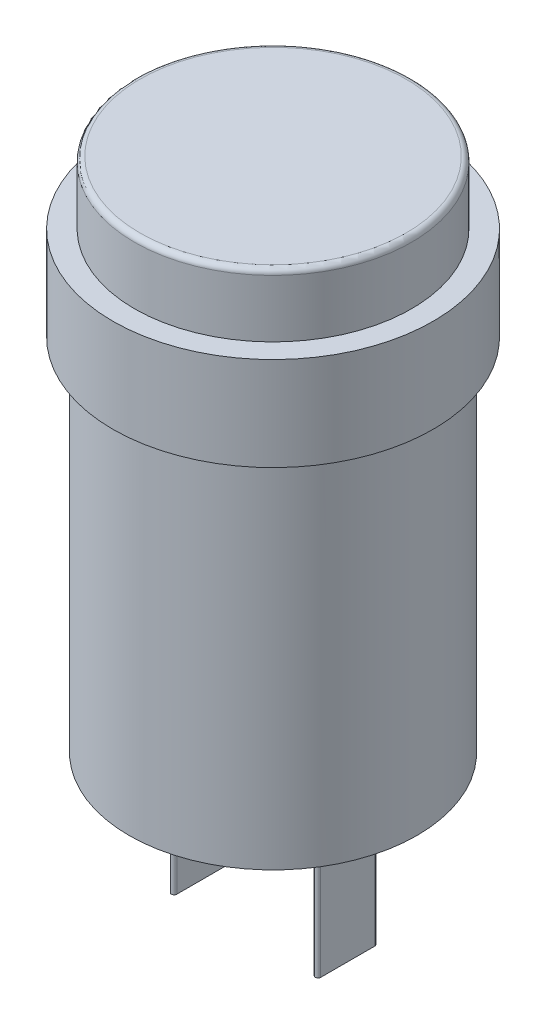
ISO-10303-21;
HEADER;
FILE_DESCRIPTION(('STEP AP214'),'2;1');
FILE_NAME('part.step','',(''),(''),'','','');
FILE_SCHEMA(('AUTOMOTIVE_DESIGN { 1 0 10303 214 1 1 1 1 }'));
ENDSEC;
DATA;
#1=APPLICATION_CONTEXT('core data for automotive mechanical design processes');
#2=APPLICATION_PROTOCOL_DEFINITION('international standard','automotive_design',2000,#1);
#3=PRODUCT_CONTEXT('',#1,'mechanical');
#4=PRODUCT('Part','Part','',(#3));
#5=PRODUCT_RELATED_PRODUCT_CATEGORY('part','',(#4));
#6=PRODUCT_DEFINITION_FORMATION('','',#4);
#7=PRODUCT_DEFINITION_CONTEXT('part definition',#1,'design');
#8=PRODUCT_DEFINITION('design','',#6,#7);
#9=PRODUCT_DEFINITION_SHAPE('','',#8);
#10=(LENGTH_UNIT() NAMED_UNIT(*) SI_UNIT(.MILLI.,.METRE.));
#11=(NAMED_UNIT(*) PLANE_ANGLE_UNIT() SI_UNIT($,.RADIAN.));
#12=(NAMED_UNIT(*) SI_UNIT($,.STERADIAN.) SOLID_ANGLE_UNIT());
#13=UNCERTAINTY_MEASURE_WITH_UNIT(LENGTH_MEASURE(1.E-05),#10,'distance_accuracy_value','');
#14=(GEOMETRIC_REPRESENTATION_CONTEXT(3) GLOBAL_UNCERTAINTY_ASSIGNED_CONTEXT((#13)) GLOBAL_UNIT_ASSIGNED_CONTEXT((#10,
#11,#12)) REPRESENTATION_CONTEXT('',''));
#15=CARTESIAN_POINT('',(0.,0.,0.));
#16=DIRECTION('',(0.,0.,1.));
#17=DIRECTION('',(1.,0.,0.));
#18=AXIS2_PLACEMENT_3D('',#15,#16,#17);
#19=CARTESIAN_POINT('',(0.,9.19984369533566,0.));
#20=DIRECTION('',(0.,1.,0.));
#21=DIRECTION('',(0.,0.,1.));
#22=AXIS2_PLACEMENT_3D('',#19,#20,#21);
#23=PLANE('',#22);
#24=CARTESIAN_POINT('',(0.,9.19984369533566,0.));
#25=DIRECTION('',(0.,1.,0.));
#26=DIRECTION('',(0.,0.,1.));
#27=AXIS2_PLACEMENT_3D('',#24,#25,#26);
#28=CIRCLE('',#27,12.2375);
#29=CARTESIAN_POINT('',(0.,9.19984369533566,12.2375));
#30=VERTEX_POINT('',#29);
#31=EDGE_CURVE('E164',#30,#30,#28,.T.);
#32=ORIENTED_EDGE('',*,*,#31,.T.);
#33=EDGE_LOOP('',(#32));
#34=FACE_BOUND('',#33,.T.);
#35=CARTESIAN_POINT('',(0.,9.19984369533566,0.));
#36=DIRECTION('',(0.,1.,0.));
#37=DIRECTION('',(0.,0.,1.));
#38=AXIS2_PLACEMENT_3D('',#35,#36,#37);
#39=CIRCLE('',#38,10.5875);
#40=CARTESIAN_POINT('',(0.,9.19984369533566,10.5875));
#41=VERTEX_POINT('',#40);
#42=EDGE_CURVE('E229',#41,#41,#39,.T.);
#43=ORIENTED_EDGE('',*,*,#42,.F.);
#44=EDGE_LOOP('',(#43));
#45=FACE_BOUND('',#44,.T.);
#46=ADVANCED_FACE('F38',(#34,#45),#23,.T.);
#47=CARTESIAN_POINT('',(0.,-25.4501563046643,0.));
#48=DIRECTION('',(0.,-1.,0.));
#49=DIRECTION('',(0.,0.,-1.));
#50=AXIS2_PLACEMENT_3D('',#47,#48,#49);
#51=PLANE('',#50);
#52=DIRECTION('',(0.,0.,-1.));
#53=VECTOR('',#52,1.);
#54=CARTESIAN_POINT('',(5.29375,-25.4501563046643,2.0625));
#55=LINE('',#54,#53);
#56=CARTESIAN_POINT('',(5.29375,-25.4501563046643,2.0625));
#57=VERTEX_POINT('',#56);
#58=CARTESIAN_POINT('',(5.29375,-25.4501563046643,-2.0625));
#59=VERTEX_POINT('',#58);
#60=EDGE_CURVE('E132',#57,#59,#55,.T.);
#61=ORIENTED_EDGE('',*,*,#60,.F.);
#62=CARTESIAN_POINT('',(5.5,-25.4501563046643,2.0625));
#63=DIRECTION('',(0.,-1.,0.));
#64=DIRECTION('',(0.,0.,-1.));
#65=AXIS2_PLACEMENT_3D('',#62,#63,#64);
#66=CIRCLE('',#65,0.206249999999999);
#67=CARTESIAN_POINT('',(5.70625,-25.4501563046643,2.0625));
#68=VERTEX_POINT('',#67);
#69=EDGE_CURVE('E129',#68,#57,#66,.T.);
#70=ORIENTED_EDGE('',*,*,#69,.F.);
#71=DIRECTION('',(0.,0.,1.));
#72=VECTOR('',#71,1.);
#73=CARTESIAN_POINT('',(5.70625,-25.4501563046643,2.0625));
#74=LINE('',#73,#72);
#75=CARTESIAN_POINT('',(5.70625,-25.4501563046643,-2.0625));
#76=VERTEX_POINT('',#75);
#77=EDGE_CURVE('E141',#76,#68,#74,.T.);
#78=ORIENTED_EDGE('',*,*,#77,.F.);
#79=CARTESIAN_POINT('',(5.5,-25.4501563046643,-2.0625));
#80=DIRECTION('',(0.,-1.,0.));
#81=DIRECTION('',(0.,0.,-1.));
#82=AXIS2_PLACEMENT_3D('',#79,#80,#81);
#83=CIRCLE('',#82,0.206249999999999);
#84=EDGE_CURVE('E149',#59,#76,#83,.T.);
#85=ORIENTED_EDGE('',*,*,#84,.F.);
#86=EDGE_LOOP('',(#61,#70,#78,#85));
#87=FACE_BOUND('',#86,.T.);
#88=CARTESIAN_POINT('',(0.,-25.4501563046643,0.));
#89=DIRECTION('',(0.,-1.,0.));
#90=DIRECTION('',(0.,0.,-1.));
#91=AXIS2_PLACEMENT_3D('',#88,#89,#90);
#92=CIRCLE('',#91,11.);
#93=CARTESIAN_POINT('',(0.,-25.4501563046643,-11.));
#94=VERTEX_POINT('',#93);
#95=EDGE_CURVE('E160',#94,#94,#92,.T.);
#96=ORIENTED_EDGE('',*,*,#95,.T.);
#97=EDGE_LOOP('',(#96));
#98=FACE_BOUND('',#97,.T.);
#99=DIRECTION('',(0.,0.,-1.));
#100=VECTOR('',#99,1.);
#101=CARTESIAN_POINT('',(-5.70625,-25.4501563046643,2.0625));
#102=LINE('',#101,#100);
#103=CARTESIAN_POINT('',(-5.70625,-25.4501563046643,2.0625));
#104=VERTEX_POINT('',#103);
#105=CARTESIAN_POINT('',(-5.70625,-25.4501563046643,-2.0625));
#106=VERTEX_POINT('',#105);
#107=EDGE_CURVE('E224',#104,#106,#102,.T.);
#108=ORIENTED_EDGE('',*,*,#107,.F.);
#109=CARTESIAN_POINT('',(-5.5,-25.4501563046643,2.0625));
#110=DIRECTION('',(0.,-1.,0.));
#111=DIRECTION('',(0.,0.,-1.));
#112=AXIS2_PLACEMENT_3D('',#109,#110,#111);
#113=CIRCLE('',#112,0.206249999999999);
#114=CARTESIAN_POINT('',(-5.29375,-25.4501563046643,2.0625));
#115=VERTEX_POINT('',#114);
#116=EDGE_CURVE('E127',#115,#104,#113,.T.);
#117=ORIENTED_EDGE('',*,*,#116,.F.);
#118=DIRECTION('',(0.,0.,1.));
#119=VECTOR('',#118,1.);
#120=CARTESIAN_POINT('',(-5.29375,-25.4501563046643,2.0625));
#121=LINE('',#120,#119);
#122=CARTESIAN_POINT('',(-5.29375,-25.4501563046643,-2.0625));
#123=VERTEX_POINT('',#122);
#124=EDGE_CURVE('E123',#123,#115,#121,.T.);
#125=ORIENTED_EDGE('',*,*,#124,.F.);
#126=CARTESIAN_POINT('',(-5.5,-25.4501563046643,-2.0625));
#127=DIRECTION('',(0.,-1.,0.));
#128=DIRECTION('',(0.,0.,-1.));
#129=AXIS2_PLACEMENT_3D('',#126,#127,#128);
#130=CIRCLE('',#129,0.206249999999999);
#131=EDGE_CURVE('E226',#106,#123,#130,.T.);
#132=ORIENTED_EDGE('',*,*,#131,.F.);
#133=EDGE_LOOP('',(#108,#117,#125,#132));
#134=FACE_BOUND('',#133,.T.);
#135=ADVANCED_FACE('F185',(#87,#98,#134),#51,.T.);
#136=CARTESIAN_POINT('',(0.,2.04984369533566,0.));
#137=DIRECTION('',(0.,1.,0.));
#138=DIRECTION('',(0.,0.,1.));
#139=AXIS2_PLACEMENT_3D('',#136,#137,#138);
#140=PLANE('',#139);
#141=CARTESIAN_POINT('',(0.,2.04984369533566,0.));
#142=DIRECTION('',(0.,1.,0.));
#143=DIRECTION('',(0.,0.,1.));
#144=AXIS2_PLACEMENT_3D('',#141,#142,#143);
#145=CIRCLE('',#144,12.2375);
#146=CARTESIAN_POINT('',(0.,2.04984369533566,12.2375));
#147=VERTEX_POINT('',#146);
#148=EDGE_CURVE('E163',#147,#147,#145,.T.);
#149=ORIENTED_EDGE('',*,*,#148,.F.);
#150=EDGE_LOOP('',(#149));
#151=FACE_BOUND('',#150,.T.);
#152=CARTESIAN_POINT('',(0.,2.04984369533566,0.));
#153=DIRECTION('',(0.,1.,0.));
#154=DIRECTION('',(0.,0.,1.));
#155=AXIS2_PLACEMENT_3D('',#152,#153,#154);
#156=CIRCLE('',#155,11.);
#157=CARTESIAN_POINT('',(0.,2.04984369533566,11.));
#158=VERTEX_POINT('',#157);
#159=EDGE_CURVE('E167',#158,#158,#156,.F.);
#160=ORIENTED_EDGE('',*,*,#159,.F.);
#161=EDGE_LOOP('',(#160));
#162=FACE_BOUND('',#161,.T.);
#163=ADVANCED_FACE('F191',(#151,#162),#140,.F.);
#164=CARTESIAN_POINT('',(0.,9.19984369533566,0.));
#165=DIRECTION('',(0.,-1.,0.));
#166=DIRECTION('',(0.,0.,-1.));
#167=AXIS2_PLACEMENT_3D('',#164,#165,#166);
#168=CYLINDRICAL_SURFACE('',#167,12.2375);
#169=ORIENTED_EDGE('',*,*,#31,.F.);
#170=EDGE_LOOP('',(#169));
#171=FACE_BOUND('',#170,.T.);
#172=ORIENTED_EDGE('',*,*,#148,.T.);
#173=EDGE_LOOP('',(#172));
#174=FACE_BOUND('',#173,.T.);
#175=ADVANCED_FACE('F199',(#171,#174),#168,.T.);
#176=CARTESIAN_POINT('',(0.,-25.4501563046643,0.));
#177=DIRECTION('',(0.,1.,0.));
#178=DIRECTION('',(0.,0.,1.));
#179=AXIS2_PLACEMENT_3D('',#176,#177,#178);
#180=CYLINDRICAL_SURFACE('',#179,11.);
#181=ORIENTED_EDGE('',*,*,#95,.F.);
#182=EDGE_LOOP('',(#181));
#183=FACE_BOUND('',#182,.T.);
#184=ORIENTED_EDGE('',*,*,#159,.T.);
#185=EDGE_LOOP('',(#184));
#186=FACE_BOUND('',#185,.T.);
#187=ADVANCED_FACE('F197',(#183,#186),#180,.T.);
#188=CARTESIAN_POINT('',(5.5,-36.4501563046643,2.0625));
#189=DIRECTION('',(0.,1.,0.));
#190=DIRECTION('',(0.,0.,1.));
#191=AXIS2_PLACEMENT_3D('',#188,#189,#190);
#192=CYLINDRICAL_SURFACE('',#191,0.206249999999999);
#193=ORIENTED_EDGE('',*,*,#69,.T.);
#194=DIRECTION('',(0.,1.,0.));
#195=VECTOR('',#194,1.);
#196=CARTESIAN_POINT('',(5.29375,-36.4501563046643,2.0625));
#197=LINE('',#196,#195);
#198=CARTESIAN_POINT('',(5.29375,-36.4501563046643,2.0625));
#199=VERTEX_POINT('',#198);
#200=EDGE_CURVE('E158',#199,#57,#197,.T.);
#201=ORIENTED_EDGE('',*,*,#200,.F.);
#202=CARTESIAN_POINT('',(5.5,-36.4501563046643,2.0625));
#203=DIRECTION('',(0.,-1.,0.));
#204=DIRECTION('',(0.,0.,-1.));
#205=AXIS2_PLACEMENT_3D('',#202,#203,#204);
#206=CIRCLE('',#205,0.206249999999999);
#207=CARTESIAN_POINT('',(5.70625,-36.4501563046643,2.0625));
#208=VERTEX_POINT('',#207);
#209=EDGE_CURVE('E137',#208,#199,#206,.T.);
#210=ORIENTED_EDGE('',*,*,#209,.F.);
#211=DIRECTION('',(0.,1.,0.));
#212=VECTOR('',#211,1.);
#213=CARTESIAN_POINT('',(5.70625,-36.4501563046643,2.0625));
#214=LINE('',#213,#212);
#215=EDGE_CURVE('E146',#208,#68,#214,.T.);
#216=ORIENTED_EDGE('',*,*,#215,.T.);
#217=EDGE_LOOP('',(#193,#201,#210,#216));
#218=FACE_BOUND('',#217,.T.);
#219=ADVANCED_FACE('F206',(#218),#192,.T.);
#220=CARTESIAN_POINT('',(5.29375,-36.4501563046643,2.0625));
#221=DIRECTION('',(1.,0.,0.));
#222=DIRECTION('',(0.,0.,-1.));
#223=AXIS2_PLACEMENT_3D('',#220,#221,#222);
#224=PLANE('',#223);
#225=ORIENTED_EDGE('',*,*,#60,.T.);
#226=DIRECTION('',(0.,1.,0.));
#227=VECTOR('',#226,1.);
#228=CARTESIAN_POINT('',(5.29375,-36.4501563046643,-2.0625));
#229=LINE('',#228,#227);
#230=CARTESIAN_POINT('',(5.29375,-36.4501563046643,-2.0625));
#231=VERTEX_POINT('',#230);
#232=EDGE_CURVE('E155',#231,#59,#229,.T.);
#233=ORIENTED_EDGE('',*,*,#232,.F.);
#234=DIRECTION('',(0.,0.,-1.));
#235=VECTOR('',#234,1.);
#236=CARTESIAN_POINT('',(5.29375,-36.4501563046643,2.0625));
#237=LINE('',#236,#235);
#238=EDGE_CURVE('E140',#199,#231,#237,.T.);
#239=ORIENTED_EDGE('',*,*,#238,.F.);
#240=ORIENTED_EDGE('',*,*,#200,.T.);
#241=EDGE_LOOP('',(#225,#233,#239,#240));
#242=FACE_BOUND('',#241,.T.);
#243=ADVANCED_FACE('F217',(#242),#224,.F.);
#244=CARTESIAN_POINT('',(5.5,-36.4501563046643,-2.0625));
#245=DIRECTION('',(0.,1.,0.));
#246=DIRECTION('',(0.,0.,1.));
#247=AXIS2_PLACEMENT_3D('',#244,#245,#246);
#248=CYLINDRICAL_SURFACE('',#247,0.206249999999999);
#249=ORIENTED_EDGE('',*,*,#84,.T.);
#250=DIRECTION('',(0.,1.,0.));
#251=VECTOR('',#250,1.);
#252=CARTESIAN_POINT('',(5.70625,-36.4501563046643,-2.0625));
#253=LINE('',#252,#251);
#254=CARTESIAN_POINT('',(5.70625,-36.4501563046643,-2.0625));
#255=VERTEX_POINT('',#254);
#256=EDGE_CURVE('E61',#255,#76,#253,.T.);
#257=ORIENTED_EDGE('',*,*,#256,.F.);
#258=CARTESIAN_POINT('',(5.5,-36.4501563046643,-2.0625));
#259=DIRECTION('',(0.,-1.,0.));
#260=DIRECTION('',(0.,0.,-1.));
#261=AXIS2_PLACEMENT_3D('',#258,#259,#260);
#262=CIRCLE('',#261,0.206249999999999);
#263=EDGE_CURVE('E143',#231,#255,#262,.T.);
#264=ORIENTED_EDGE('',*,*,#263,.F.);
#265=ORIENTED_EDGE('',*,*,#232,.T.);
#266=EDGE_LOOP('',(#249,#257,#264,#265));
#267=FACE_BOUND('',#266,.T.);
#268=ADVANCED_FACE('F266',(#267),#248,.T.);
#269=CARTESIAN_POINT('',(5.70625,-36.4501563046643,2.0625));
#270=DIRECTION('',(-1.,0.,0.));
#271=DIRECTION('',(0.,0.,1.));
#272=AXIS2_PLACEMENT_3D('',#269,#270,#271);
#273=PLANE('',#272);
#274=ORIENTED_EDGE('',*,*,#77,.T.);
#275=ORIENTED_EDGE('',*,*,#215,.F.);
#276=DIRECTION('',(0.,0.,1.));
#277=VECTOR('',#276,1.);
#278=CARTESIAN_POINT('',(5.70625,-36.4501563046643,2.0625));
#279=LINE('',#278,#277);
#280=EDGE_CURVE('E145',#255,#208,#279,.T.);
#281=ORIENTED_EDGE('',*,*,#280,.F.);
#282=ORIENTED_EDGE('',*,*,#256,.T.);
#283=EDGE_LOOP('',(#274,#275,#281,#282));
#284=FACE_BOUND('',#283,.T.);
#285=ADVANCED_FACE('F262',(#284),#273,.F.);
#286=CARTESIAN_POINT('',(5.5,-36.4501563046643,2.0625));
#287=DIRECTION('',(0.,-1.,0.));
#288=DIRECTION('',(0.,0.,-1.));
#289=AXIS2_PLACEMENT_3D('',#286,#287,#288);
#290=PLANE('',#289);
#291=ORIENTED_EDGE('',*,*,#209,.T.);
#292=ORIENTED_EDGE('',*,*,#238,.T.);
#293=ORIENTED_EDGE('',*,*,#263,.T.);
#294=ORIENTED_EDGE('',*,*,#280,.T.);
#295=EDGE_LOOP('',(#291,#292,#293,#294));
#296=FACE_BOUND('',#295,.T.);
#297=ADVANCED_FACE('F259',(#296),#290,.T.);
#298=CARTESIAN_POINT('',(-5.5,-36.4501563046643,2.0625));
#299=DIRECTION('',(0.,1.,0.));
#300=DIRECTION('',(0.,0.,1.));
#301=AXIS2_PLACEMENT_3D('',#298,#299,#300);
#302=CYLINDRICAL_SURFACE('',#301,0.206249999999999);
#303=ORIENTED_EDGE('',*,*,#116,.T.);
#304=DIRECTION('',(0.,1.,0.));
#305=VECTOR('',#304,1.);
#306=CARTESIAN_POINT('',(-5.70625,-36.4501563046643,2.0625));
#307=LINE('',#306,#305);
#308=CARTESIAN_POINT('',(-5.70625,-36.4501563046643,2.0625));
#309=VERTEX_POINT('',#308);
#310=EDGE_CURVE('E108',#309,#104,#307,.T.);
#311=ORIENTED_EDGE('',*,*,#310,.F.);
#312=CARTESIAN_POINT('',(-5.5,-36.4501563046643,2.0625));
#313=DIRECTION('',(0.,-1.,0.));
#314=DIRECTION('',(0.,0.,-1.));
#315=AXIS2_PLACEMENT_3D('',#312,#313,#314);
#316=CIRCLE('',#315,0.206249999999999);
#317=CARTESIAN_POINT('',(-5.29375,-36.4501563046643,2.0625));
#318=VERTEX_POINT('',#317);
#319=EDGE_CURVE('E115',#318,#309,#316,.T.);
#320=ORIENTED_EDGE('',*,*,#319,.F.);
#321=DIRECTION('',(0.,1.,0.));
#322=VECTOR('',#321,1.);
#323=CARTESIAN_POINT('',(-5.29375,-36.4501563046643,2.0625));
#324=LINE('',#323,#322);
#325=EDGE_CURVE('E234',#318,#115,#324,.T.);
#326=ORIENTED_EDGE('',*,*,#325,.T.);
#327=EDGE_LOOP('',(#303,#311,#320,#326));
#328=FACE_BOUND('',#327,.T.);
#329=ADVANCED_FACE('F125',(#328),#302,.T.);
#330=CARTESIAN_POINT('',(-5.70625,-36.4501563046643,2.0625));
#331=DIRECTION('',(1.,0.,0.));
#332=DIRECTION('',(0.,0.,-1.));
#333=AXIS2_PLACEMENT_3D('',#330,#331,#332);
#334=PLANE('',#333);
#335=ORIENTED_EDGE('',*,*,#107,.T.);
#336=DIRECTION('',(0.,1.,0.));
#337=VECTOR('',#336,1.);
#338=CARTESIAN_POINT('',(-5.70625,-36.4501563046643,-2.0625));
#339=LINE('',#338,#337);
#340=CARTESIAN_POINT('',(-5.70625,-36.4501563046643,-2.0625));
#341=VERTEX_POINT('',#340);
#342=EDGE_CURVE('E111',#341,#106,#339,.T.);
#343=ORIENTED_EDGE('',*,*,#342,.F.);
#344=DIRECTION('',(0.,0.,-1.));
#345=VECTOR('',#344,1.);
#346=CARTESIAN_POINT('',(-5.70625,-36.4501563046643,2.0625));
#347=LINE('',#346,#345);
#348=EDGE_CURVE('E104',#309,#341,#347,.T.);
#349=ORIENTED_EDGE('',*,*,#348,.F.);
#350=ORIENTED_EDGE('',*,*,#310,.T.);
#351=EDGE_LOOP('',(#335,#343,#349,#350));
#352=FACE_BOUND('',#351,.T.);
#353=ADVANCED_FACE('F106',(#352),#334,.F.);
#354=CARTESIAN_POINT('',(-5.5,-36.4501563046643,-2.0625));
#355=DIRECTION('',(0.,1.,0.));
#356=DIRECTION('',(0.,0.,1.));
#357=AXIS2_PLACEMENT_3D('',#354,#355,#356);
#358=CYLINDRICAL_SURFACE('',#357,0.206249999999999);
#359=ORIENTED_EDGE('',*,*,#131,.T.);
#360=DIRECTION('',(0.,1.,0.));
#361=VECTOR('',#360,1.);
#362=CARTESIAN_POINT('',(-5.29375,-36.4501563046643,-2.0625));
#363=LINE('',#362,#361);
#364=CARTESIAN_POINT('',(-5.29375,-36.4501563046643,-2.0625));
#365=VERTEX_POINT('',#364);
#366=EDGE_CURVE('E53',#365,#123,#363,.T.);
#367=ORIENTED_EDGE('',*,*,#366,.F.);
#368=CARTESIAN_POINT('',(-5.5,-36.4501563046643,-2.0625));
#369=DIRECTION('',(0.,-1.,0.));
#370=DIRECTION('',(0.,0.,-1.));
#371=AXIS2_PLACEMENT_3D('',#368,#369,#370);
#372=CIRCLE('',#371,0.206249999999999);
#373=EDGE_CURVE('E114',#341,#365,#372,.T.);
#374=ORIENTED_EDGE('',*,*,#373,.F.);
#375=ORIENTED_EDGE('',*,*,#342,.T.);
#376=EDGE_LOOP('',(#359,#367,#374,#375));
#377=FACE_BOUND('',#376,.T.);
#378=ADVANCED_FACE('F251',(#377),#358,.T.);
#379=CARTESIAN_POINT('',(-5.29375,-36.4501563046643,2.0625));
#380=DIRECTION('',(-1.,0.,0.));
#381=DIRECTION('',(0.,0.,1.));
#382=AXIS2_PLACEMENT_3D('',#379,#380,#381);
#383=PLANE('',#382);
#384=ORIENTED_EDGE('',*,*,#124,.T.);
#385=ORIENTED_EDGE('',*,*,#325,.F.);
#386=DIRECTION('',(0.,0.,1.));
#387=VECTOR('',#386,1.);
#388=CARTESIAN_POINT('',(-5.29375,-36.4501563046643,2.0625));
#389=LINE('',#388,#387);
#390=EDGE_CURVE('E119',#365,#318,#389,.T.);
#391=ORIENTED_EDGE('',*,*,#390,.F.);
#392=ORIENTED_EDGE('',*,*,#366,.T.);
#393=EDGE_LOOP('',(#384,#385,#391,#392));
#394=FACE_BOUND('',#393,.T.);
#395=ADVANCED_FACE('F246',(#394),#383,.F.);
#396=CARTESIAN_POINT('',(-5.5,-36.4501563046643,2.0625));
#397=DIRECTION('',(0.,-1.,0.));
#398=DIRECTION('',(0.,0.,-1.));
#399=AXIS2_PLACEMENT_3D('',#396,#397,#398);
#400=PLANE('',#399);
#401=ORIENTED_EDGE('',*,*,#319,.T.);
#402=ORIENTED_EDGE('',*,*,#348,.T.);
#403=ORIENTED_EDGE('',*,*,#373,.T.);
#404=ORIENTED_EDGE('',*,*,#390,.T.);
#405=EDGE_LOOP('',(#401,#402,#403,#404));
#406=FACE_BOUND('',#405,.T.);
#407=ADVANCED_FACE('F118',(#406),#400,.T.);
#408=CARTESIAN_POINT('',(0.,14.0123436953357,0.));
#409=DIRECTION('',(0.,-1.,0.));
#410=DIRECTION('',(0.,0.,-1.));
#411=AXIS2_PLACEMENT_3D('',#408,#409,#410);
#412=CYLINDRICAL_SURFACE('',#411,10.5875);
#413=CARTESIAN_POINT('',(0.,13.5998436953357,0.));
#414=DIRECTION('',(0.,1.,0.));
#415=DIRECTION('',(0.,0.,1.));
#416=AXIS2_PLACEMENT_3D('',#413,#414,#415);
#417=CIRCLE('',#416,10.5875);
#418=CARTESIAN_POINT('',(0.,13.5998436953357,10.5875));
#419=VERTEX_POINT('',#418);
#420=EDGE_CURVE('E11',#419,#419,#417,.F.);
#421=ORIENTED_EDGE('',*,*,#420,.T.);
#422=EDGE_LOOP('',(#421));
#423=FACE_BOUND('',#422,.T.);
#424=ORIENTED_EDGE('',*,*,#42,.T.);
#425=EDGE_LOOP('',(#424));
#426=FACE_BOUND('',#425,.T.);
#427=ADVANCED_FACE('F181',(#423,#426),#412,.T.);
#428=CARTESIAN_POINT('',(0.,14.0123436953357,0.));
#429=DIRECTION('',(0.,1.,0.));
#430=DIRECTION('',(0.,0.,1.));
#431=AXIS2_PLACEMENT_3D('',#428,#429,#430);
#432=PLANE('',#431);
#433=CARTESIAN_POINT('',(0.,14.0123436953357,0.));
#434=DIRECTION('',(0.,1.,0.));
#435=DIRECTION('',(0.,0.,1.));
#436=AXIS2_PLACEMENT_3D('',#433,#434,#435);
#437=CIRCLE('',#436,10.175);
#438=CARTESIAN_POINT('',(0.,14.0123436953357,10.175));
#439=VERTEX_POINT('',#438);
#440=EDGE_CURVE('E46',#439,#439,#437,.T.);
#441=ORIENTED_EDGE('',*,*,#440,.T.);
#442=EDGE_LOOP('',(#441));
#443=FACE_BOUND('',#442,.T.);
#444=ADVANCED_FACE('F174',(#443),#432,.T.);
#445=CARTESIAN_POINT('',(0.,13.5998436953357,0.));
#446=DIRECTION('',(0.,1.,0.));
#447=DIRECTION('',(0.,0.,1.));
#448=AXIS2_PLACEMENT_3D('',#445,#446,#447);
#449=TOROIDAL_SURFACE('',#448,10.175,0.4125);
#450=ORIENTED_EDGE('',*,*,#420,.F.);
#451=EDGE_LOOP('',(#450));
#452=FACE_BOUND('',#451,.T.);
#453=ORIENTED_EDGE('',*,*,#440,.F.);
#454=EDGE_LOOP('',(#453));
#455=FACE_BOUND('',#454,.T.);
#456=ADVANCED_FACE('F40',(#452,#455),#449,.T.);
#457=CLOSED_SHELL('',(#46,#135,#163,#175,#187,#219,#243,#268,#285,#297,#329,#353,#378,#395,#407,
#427,#444,#456));
#458=MANIFOLD_SOLID_BREP('B2',#457);
#459=ADVANCED_BREP_SHAPE_REPRESENTATION('',(#18,#458),#14);
#460=SHAPE_DEFINITION_REPRESENTATION(#9,#459);
ENDSEC;
END-ISO-10303-21;
